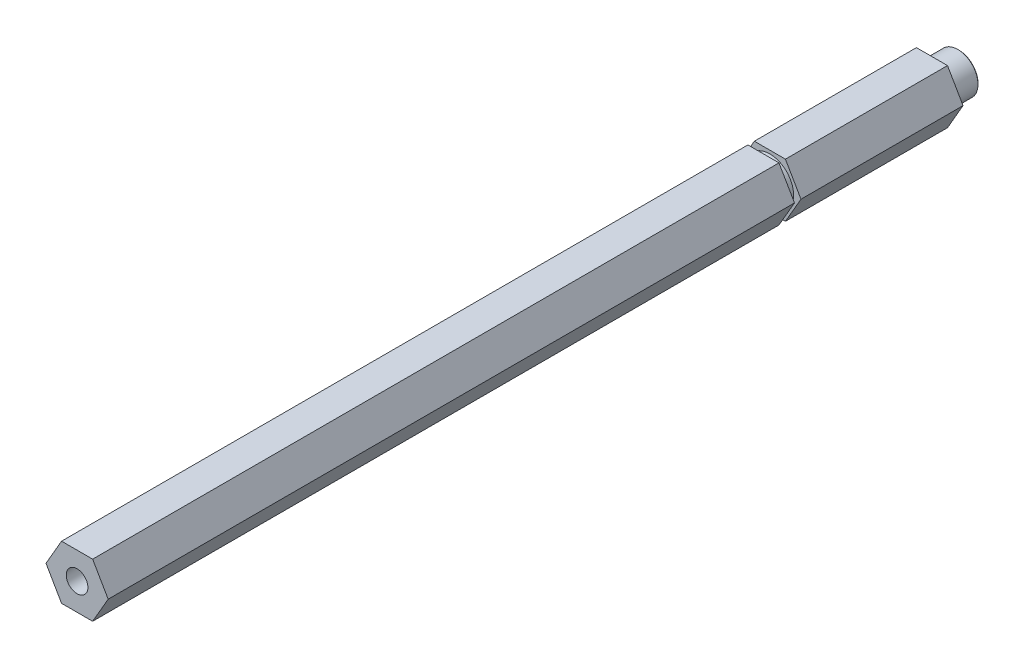
ISO-10303-21;
HEADER;
FILE_DESCRIPTION(('STEP AP214'),'2;1');
FILE_NAME('part.step','',(''),(''),'','','');
FILE_SCHEMA(('AUTOMOTIVE_DESIGN { 1 0 10303 214 1 1 1 1 }'));
ENDSEC;
DATA;
#1=APPLICATION_CONTEXT('core data for automotive mechanical design processes');
#2=APPLICATION_PROTOCOL_DEFINITION('international standard','automotive_design',2000,#1);
#3=PRODUCT_CONTEXT('',#1,'mechanical');
#4=PRODUCT('Part','Part','',(#3));
#5=PRODUCT_RELATED_PRODUCT_CATEGORY('part','',(#4));
#6=PRODUCT_DEFINITION_FORMATION('','',#4);
#7=PRODUCT_DEFINITION_CONTEXT('part definition',#1,'design');
#8=PRODUCT_DEFINITION('design','',#6,#7);
#9=PRODUCT_DEFINITION_SHAPE('','',#8);
#10=(LENGTH_UNIT() NAMED_UNIT(*) SI_UNIT(.MILLI.,.METRE.));
#11=(NAMED_UNIT(*) PLANE_ANGLE_UNIT() SI_UNIT($,.RADIAN.));
#12=(NAMED_UNIT(*) SI_UNIT($,.STERADIAN.) SOLID_ANGLE_UNIT());
#13=UNCERTAINTY_MEASURE_WITH_UNIT(LENGTH_MEASURE(1.E-05),#10,'distance_accuracy_value','');
#14=(GEOMETRIC_REPRESENTATION_CONTEXT(3) GLOBAL_UNCERTAINTY_ASSIGNED_CONTEXT((#13)) GLOBAL_UNIT_ASSIGNED_CONTEXT((#10,
#11,#12)) REPRESENTATION_CONTEXT('',''));
#15=CARTESIAN_POINT('',(0.,0.,0.));
#16=DIRECTION('',(0.,0.,1.));
#17=DIRECTION('',(1.,0.,0.));
#18=AXIS2_PLACEMENT_3D('',#15,#16,#17);
#19=CARTESIAN_POINT('',(0.,0.,11.176));
#20=DIRECTION('',(0.,0.,-1.));
#21=DIRECTION('',(-1.,0.,0.));
#22=AXIS2_PLACEMENT_3D('',#19,#20,#21);
#23=PLANE('',#22);
#24=CARTESIAN_POINT('',(0.,0.,11.176));
#25=DIRECTION('',(0.,0.,-1.));
#26=DIRECTION('',(-1.,0.,0.));
#27=AXIS2_PLACEMENT_3D('',#24,#25,#26);
#28=CIRCLE('',#27,3.175);
#29=CARTESIAN_POINT('',(-3.175,0.,11.176));
#30=VERTEX_POINT('',#29);
#31=EDGE_CURVE('E20',#30,#30,#28,.T.);
#32=ORIENTED_EDGE('',*,*,#31,.T.);
#33=EDGE_LOOP('',(#32));
#34=FACE_BOUND('',#33,.T.);
#35=ADVANCED_FACE('F17',(#34),#23,.T.);
#36=CARTESIAN_POINT('',(0.,0.,11.176));
#37=DIRECTION('',(0.,0.,-1.));
#38=DIRECTION('',(-1.,0.,0.));
#39=AXIS2_PLACEMENT_3D('',#36,#37,#38);
#40=CYLINDRICAL_SURFACE('',#39,3.175);
#41=CARTESIAN_POINT('',(0.,0.,0.253999999983989));
#42=DIRECTION('',(0.,0.,-1.));
#43=DIRECTION('',(-1.,0.,0.));
#44=AXIS2_PLACEMENT_3D('',#41,#42,#43);
#45=CIRCLE('',#44,3.17500000005566);
#46=CARTESIAN_POINT('',(-3.17500000005566,0.,0.253999999983989));
#47=VERTEX_POINT('',#46);
#48=EDGE_CURVE('E139',#47,#47,#45,.T.);
#49=ORIENTED_EDGE('',*,*,#48,.T.);
#50=EDGE_LOOP('',(#49));
#51=FACE_BOUND('',#50,.T.);
#52=ORIENTED_EDGE('',*,*,#31,.F.);
#53=EDGE_LOOP('',(#52));
#54=FACE_BOUND('',#53,.T.);
#55=ADVANCED_FACE('F401',(#51,#54),#40,.F.);
#56=CARTESIAN_POINT('',(0.,0.,5.6843418860808E-11));
#57=DIRECTION('',(0.,0.,-1.));
#58=DIRECTION('',(-1.,0.,0.));
#59=AXIS2_PLACEMENT_3D('',#56,#57,#58);
#60=CONICAL_SURFACE('',#59,3.42899999992596,0.785398163397448);
#61=CARTESIAN_POINT('',(0.,0.,0.));
#62=DIRECTION('',(0.,0.,-1.));
#63=DIRECTION('',(-1.,0.,0.));
#64=AXIS2_PLACEMENT_3D('',#61,#62,#63);
#65=CIRCLE('',#64,3.42899999998281);
#66=CARTESIAN_POINT('',(-3.42899999998281,0.,0.));
#67=VERTEX_POINT('',#66);
#68=EDGE_CURVE('E142',#67,#67,#65,.T.);
#69=ORIENTED_EDGE('',*,*,#68,.T.);
#70=EDGE_LOOP('',(#69));
#71=FACE_BOUND('',#70,.T.);
#72=ORIENTED_EDGE('',*,*,#48,.F.);
#73=EDGE_LOOP('',(#72));
#74=FACE_BOUND('',#73,.T.);
#75=ADVANCED_FACE('F163',(#71,#74),#60,.F.);
#76=CARTESIAN_POINT('',(0.,0.,0.));
#77=DIRECTION('',(0.,0.,1.));
#78=DIRECTION('',(1.,0.,0.));
#79=AXIS2_PLACEMENT_3D('',#76,#77,#78);
#80=PLANE('',#79);
#81=ORIENTED_EDGE('',*,*,#68,.F.);
#82=EDGE_LOOP('',(#81));
#83=FACE_BOUND('',#82,.T.);
#84=CARTESIAN_POINT('',(0.,0.,-5.6843418860808E-11));
#85=DIRECTION('',(0.,0.,1.));
#86=DIRECTION('',(1.,0.,0.));
#87=AXIS2_PLACEMENT_3D('',#84,#85,#86);
#88=CIRCLE('',#87,4.50849999998582);
#89=CARTESIAN_POINT('',(4.50849999998582,0.,-5.6843418860808E-11));
#90=VERTEX_POINT('',#89);
#91=EDGE_CURVE('E138',#90,#90,#88,.T.);
#92=ORIENTED_EDGE('',*,*,#91,.F.);
#93=EDGE_LOOP('',(#92));
#94=FACE_BOUND('',#93,.T.);
#95=ADVANCED_FACE('F166',(#83,#94),#80,.F.);
#96=CARTESIAN_POINT('',(0.,0.,0.254000000097676));
#97=DIRECTION('',(0.,0.,1.));
#98=DIRECTION('',(1.,0.,0.));
#99=AXIS2_PLACEMENT_3D('',#96,#97,#98);
#100=CONICAL_SURFACE('',#99,4.76250000014034,0.785398163397448);
#101=ORIENTED_EDGE('',*,*,#91,.T.);
#102=EDGE_LOOP('',(#101));
#103=FACE_BOUND('',#102,.T.);
#104=CARTESIAN_POINT('',(0.,0.,0.253999999999984));
#105=DIRECTION('',(0.,0.,-1.));
#106=DIRECTION('',(-1.,0.,0.));
#107=AXIS2_PLACEMENT_3D('',#104,#105,#106);
#108=CIRCLE('',#107,4.7625);
#109=CARTESIAN_POINT('',(-4.7625,0.,0.253999999999984));
#110=VERTEX_POINT('',#109);
#111=EDGE_CURVE('E135',#110,#110,#108,.F.);
#112=ORIENTED_EDGE('',*,*,#111,.F.);
#113=EDGE_LOOP('',(#112));
#114=FACE_BOUND('',#113,.T.);
#115=ADVANCED_FACE('F169',(#103,#114),#100,.T.);
#116=CARTESIAN_POINT('',(0.,0.,6.35));
#117=DIRECTION('',(0.,0.,-1.));
#118=DIRECTION('',(-1.,0.,0.));
#119=AXIS2_PLACEMENT_3D('',#116,#117,#118);
#120=CYLINDRICAL_SURFACE('',#119,4.7625);
#121=CARTESIAN_POINT('',(0.,0.,6.35));
#122=DIRECTION('',(0.,0.,-1.));
#123=DIRECTION('',(-1.,0.,0.));
#124=AXIS2_PLACEMENT_3D('',#121,#122,#123);
#125=CIRCLE('',#124,4.7625);
#126=CARTESIAN_POINT('',(-4.7625,0.,6.35));
#127=VERTEX_POINT('',#126);
#128=EDGE_CURVE('E117',#127,#127,#125,.T.);
#129=ORIENTED_EDGE('',*,*,#128,.T.);
#130=EDGE_LOOP('',(#129));
#131=FACE_BOUND('',#130,.T.);
#132=ORIENTED_EDGE('',*,*,#111,.T.);
#133=EDGE_LOOP('',(#132));
#134=FACE_BOUND('',#133,.T.);
#135=ADVANCED_FACE('F175',(#131,#134),#120,.T.);
#136=CARTESIAN_POINT('',(0.,0.,6.35));
#137=DIRECTION('',(0.,0.,1.));
#138=DIRECTION('',(1.,0.,0.));
#139=AXIS2_PLACEMENT_3D('',#136,#137,#138);
#140=PLANE('',#139);
#141=ORIENTED_EDGE('',*,*,#128,.F.);
#142=EDGE_LOOP('',(#141));
#143=FACE_BOUND('',#142,.T.);
#144=DIRECTION('',(-1.,0.,0.));
#145=VECTOR('',#144,1.);
#146=CARTESIAN_POINT('',(-3.66617420935412,-6.35,6.35));
#147=LINE('',#146,#145);
#148=CARTESIAN_POINT('',(3.66617420935412,-6.35,6.35));
#149=VERTEX_POINT('',#148);
#150=CARTESIAN_POINT('',(-3.66617420935412,-6.35,6.35));
#151=VERTEX_POINT('',#150);
#152=EDGE_CURVE('E481',#149,#151,#147,.T.);
#153=ORIENTED_EDGE('',*,*,#152,.T.);
#154=DIRECTION('',(-0.5,0.866025403784438,0.));
#155=VECTOR('',#154,1.);
#156=CARTESIAN_POINT('',(-7.33234841870825,0.,6.35));
#157=LINE('',#156,#155);
#158=CARTESIAN_POINT('',(-7.33234841870825,0.,6.35));
#159=VERTEX_POINT('',#158);
#160=EDGE_CURVE('E491',#151,#159,#157,.T.);
#161=ORIENTED_EDGE('',*,*,#160,.T.);
#162=DIRECTION('',(0.5,0.866025403784439,0.));
#163=VECTOR('',#162,1.);
#164=CARTESIAN_POINT('',(-3.66617420935412,6.35,6.35));
#165=LINE('',#164,#163);
#166=CARTESIAN_POINT('',(-3.66617420935412,6.35,6.35));
#167=VERTEX_POINT('',#166);
#168=EDGE_CURVE('E463',#159,#167,#165,.T.);
#169=ORIENTED_EDGE('',*,*,#168,.T.);
#170=DIRECTION('',(1.,0.,0.));
#171=VECTOR('',#170,1.);
#172=CARTESIAN_POINT('',(3.66617420935412,6.35,6.35));
#173=LINE('',#172,#171);
#174=CARTESIAN_POINT('',(3.66617420935412,6.35,6.35));
#175=VERTEX_POINT('',#174);
#176=EDGE_CURVE('E129',#167,#175,#173,.T.);
#177=ORIENTED_EDGE('',*,*,#176,.T.);
#178=DIRECTION('',(0.5,-0.866025403784439,0.));
#179=VECTOR('',#178,1.);
#180=CARTESIAN_POINT('',(7.33234841870825,0.,6.34999999999999));
#181=LINE('',#180,#179);
#182=CARTESIAN_POINT('',(7.33234841870825,0.,6.35));
#183=VERTEX_POINT('',#182);
#184=EDGE_CURVE('E122',#175,#183,#181,.T.);
#185=ORIENTED_EDGE('',*,*,#184,.T.);
#186=DIRECTION('',(-0.5,-0.866025403784439,0.));
#187=VECTOR('',#186,1.);
#188=CARTESIAN_POINT('',(3.66617420935412,-6.35,6.35));
#189=LINE('',#188,#187);
#190=EDGE_CURVE('E106',#183,#149,#189,.T.);
#191=ORIENTED_EDGE('',*,*,#190,.T.);
#192=EDGE_LOOP('',(#153,#161,#169,#177,#185,#191));
#193=FACE_BOUND('',#192,.T.);
#194=ADVANCED_FACE('F127',(#143,#193),#140,.F.);
#195=CARTESIAN_POINT('',(3.66617420935412,-6.35,44.577));
#196=DIRECTION('',(-0.866025403784439,0.5,0.));
#197=DIRECTION('',(-0.5,-0.866025403784439,0.));
#198=AXIS2_PLACEMENT_3D('',#195,#196,#197);
#199=PLANE('',#198);
#200=DIRECTION('',(0.,0.,1.));
#201=VECTOR('',#200,1.);
#202=CARTESIAN_POINT('',(7.33234841870825,0.,44.577));
#203=LINE('',#202,#201);
#204=CARTESIAN_POINT('',(7.33234841870825,0.,44.577));
#205=VERTEX_POINT('',#204);
#206=EDGE_CURVE('E110',#183,#205,#203,.T.);
#207=ORIENTED_EDGE('',*,*,#206,.T.);
#208=DIRECTION('',(0.5,0.866025403784439,0.));
#209=VECTOR('',#208,1.);
#210=CARTESIAN_POINT('',(3.66617420935412,-6.35,44.577));
#211=LINE('',#210,#209);
#212=CARTESIAN_POINT('',(3.66617420935412,-6.35,44.577));
#213=VERTEX_POINT('',#212);
#214=EDGE_CURVE('E479',#213,#205,#211,.T.);
#215=ORIENTED_EDGE('',*,*,#214,.F.);
#216=DIRECTION('',(0.,0.,1.));
#217=VECTOR('',#216,1.);
#218=CARTESIAN_POINT('',(3.66617420935412,-6.35,44.577));
#219=LINE('',#218,#217);
#220=EDGE_CURVE('E112',#213,#149,#219,.F.);
#221=ORIENTED_EDGE('',*,*,#220,.T.);
#222=ORIENTED_EDGE('',*,*,#190,.F.);
#223=EDGE_LOOP('',(#207,#215,#221,#222));
#224=FACE_BOUND('',#223,.T.);
#225=ADVANCED_FACE('F108',(#224),#199,.F.);
#226=CARTESIAN_POINT('',(7.33234841870825,0.,44.577));
#227=DIRECTION('',(-0.866025403784439,-0.5,0.));
#228=DIRECTION('',(0.5,-0.866025403784439,0.));
#229=AXIS2_PLACEMENT_3D('',#226,#227,#228);
#230=PLANE('',#229);
#231=DIRECTION('',(0.,0.,-1.));
#232=VECTOR('',#231,1.);
#233=CARTESIAN_POINT('',(3.66617420935412,6.35,44.577));
#234=LINE('',#233,#232);
#235=CARTESIAN_POINT('',(3.66617420935412,6.35,44.577));
#236=VERTEX_POINT('',#235);
#237=EDGE_CURVE('E130',#175,#236,#234,.F.);
#238=ORIENTED_EDGE('',*,*,#237,.T.);
#239=DIRECTION('',(-0.5,0.866025403784438,0.));
#240=VECTOR('',#239,1.);
#241=CARTESIAN_POINT('',(7.33234841870825,0.,44.577));
#242=LINE('',#241,#240);
#243=EDGE_CURVE('E124',#205,#236,#242,.T.);
#244=ORIENTED_EDGE('',*,*,#243,.F.);
#245=ORIENTED_EDGE('',*,*,#206,.F.);
#246=ORIENTED_EDGE('',*,*,#184,.F.);
#247=EDGE_LOOP('',(#238,#244,#245,#246));
#248=FACE_BOUND('',#247,.T.);
#249=ADVANCED_FACE('F121',(#248),#230,.F.);
#250=CARTESIAN_POINT('',(3.66617420935412,6.35,44.577));
#251=DIRECTION('',(0.,-1.,0.));
#252=DIRECTION('',(0.,0.,-1.));
#253=AXIS2_PLACEMENT_3D('',#250,#251,#252);
#254=PLANE('',#253);
#255=DIRECTION('',(0.,0.,1.));
#256=VECTOR('',#255,1.);
#257=CARTESIAN_POINT('',(-3.66617420935412,6.35,44.577));
#258=LINE('',#257,#256);
#259=CARTESIAN_POINT('',(-3.66617420935412,6.35,44.577));
#260=VERTEX_POINT('',#259);
#261=EDGE_CURVE('E460',#167,#260,#258,.T.);
#262=ORIENTED_EDGE('',*,*,#261,.T.);
#263=DIRECTION('',(1.,0.,0.));
#264=VECTOR('',#263,1.);
#265=CARTESIAN_POINT('',(0.,6.35,44.577));
#266=LINE('',#265,#264);
#267=EDGE_CURVE('E462',#236,#260,#266,.F.);
#268=ORIENTED_EDGE('',*,*,#267,.F.);
#269=ORIENTED_EDGE('',*,*,#237,.F.);
#270=ORIENTED_EDGE('',*,*,#176,.F.);
#271=EDGE_LOOP('',(#262,#268,#269,#270));
#272=FACE_BOUND('',#271,.T.);
#273=ADVANCED_FACE('F251',(#272),#254,.F.);
#274=CARTESIAN_POINT('',(-3.66617420935412,6.35,44.577));
#275=DIRECTION('',(0.866025403784439,-0.5,0.));
#276=DIRECTION('',(0.5,0.866025403784439,0.));
#277=AXIS2_PLACEMENT_3D('',#274,#275,#276);
#278=PLANE('',#277);
#279=DIRECTION('',(0.,0.,1.));
#280=VECTOR('',#279,1.);
#281=CARTESIAN_POINT('',(-7.33234841870825,0.,44.577));
#282=LINE('',#281,#280);
#283=CARTESIAN_POINT('',(-7.33234841870825,0.,44.577));
#284=VERTEX_POINT('',#283);
#285=EDGE_CURVE('E468',#159,#284,#282,.T.);
#286=ORIENTED_EDGE('',*,*,#285,.T.);
#287=DIRECTION('',(-0.5,-0.866025403784438,0.));
#288=VECTOR('',#287,1.);
#289=CARTESIAN_POINT('',(-3.66617420935412,6.35,44.577));
#290=LINE('',#289,#288);
#291=EDGE_CURVE('E466',#260,#284,#290,.T.);
#292=ORIENTED_EDGE('',*,*,#291,.F.);
#293=ORIENTED_EDGE('',*,*,#261,.F.);
#294=ORIENTED_EDGE('',*,*,#168,.F.);
#295=EDGE_LOOP('',(#286,#292,#293,#294));
#296=FACE_BOUND('',#295,.T.);
#297=ADVANCED_FACE('F247',(#296),#278,.F.);
#298=CARTESIAN_POINT('',(-7.33234841870825,0.,44.577));
#299=DIRECTION('',(0.866025403784438,0.5,0.));
#300=DIRECTION('',(-0.5,0.866025403784438,0.));
#301=AXIS2_PLACEMENT_3D('',#298,#299,#300);
#302=PLANE('',#301);
#303=DIRECTION('',(0.,0.,1.));
#304=VECTOR('',#303,1.);
#305=CARTESIAN_POINT('',(-3.66617420935412,-6.35,44.577));
#306=LINE('',#305,#304);
#307=CARTESIAN_POINT('',(-3.66617420935412,-6.35,44.577));
#308=VERTEX_POINT('',#307);
#309=EDGE_CURVE('E488',#151,#308,#306,.T.);
#310=ORIENTED_EDGE('',*,*,#309,.T.);
#311=DIRECTION('',(0.5,-0.866025403784438,0.));
#312=VECTOR('',#311,1.);
#313=CARTESIAN_POINT('',(-7.33234841870825,0.,44.577));
#314=LINE('',#313,#312);
#315=EDGE_CURVE('E471',#284,#308,#314,.T.);
#316=ORIENTED_EDGE('',*,*,#315,.F.);
#317=ORIENTED_EDGE('',*,*,#285,.F.);
#318=ORIENTED_EDGE('',*,*,#160,.F.);
#319=EDGE_LOOP('',(#310,#316,#317,#318));
#320=FACE_BOUND('',#319,.T.);
#321=ADVANCED_FACE('F243',(#320),#302,.F.);
#322=CARTESIAN_POINT('',(-3.66617420935412,-6.35,44.577));
#323=DIRECTION('',(0.,1.,0.));
#324=DIRECTION('',(-1.,0.,0.));
#325=AXIS2_PLACEMENT_3D('',#322,#323,#324);
#326=PLANE('',#325);
#327=ORIENTED_EDGE('',*,*,#220,.F.);
#328=DIRECTION('',(1.,0.,0.));
#329=VECTOR('',#328,1.);
#330=CARTESIAN_POINT('',(0.,-6.35,44.577));
#331=LINE('',#330,#329);
#332=EDGE_CURVE('E473',#308,#213,#331,.T.);
#333=ORIENTED_EDGE('',*,*,#332,.F.);
#334=ORIENTED_EDGE('',*,*,#309,.F.);
#335=ORIENTED_EDGE('',*,*,#152,.F.);
#336=EDGE_LOOP('',(#327,#333,#334,#335));
#337=FACE_BOUND('',#336,.T.);
#338=ADVANCED_FACE('F239',(#337),#326,.F.);
#339=CARTESIAN_POINT('',(0.,0.,191.46773999995));
#340=DIRECTION('',(0.,0.,1.));
#341=DIRECTION('',(1.,0.,0.));
#342=AXIS2_PLACEMENT_3D('',#339,#340,#341);
#343=CONICAL_SURFACE('',#342,2.55269999991015,1.02974425853382);
#344=CARTESIAN_POINT('',(-1.70530256582424E-10,0.,189.933923097726));
#345=VERTEX_POINT('',#344);
#346=VERTEX_LOOP('',#345);
#347=FACE_BOUND('',#346,.T.);
#348=CARTESIAN_POINT('',(0.,0.,191.46774));
#349=DIRECTION('',(0.,0.,1.));
#350=DIRECTION('',(1.,0.,0.));
#351=AXIS2_PLACEMENT_3D('',#348,#349,#350);
#352=CIRCLE('',#351,2.55269999999999);
#353=CARTESIAN_POINT('',(2.55269999999999,0.,191.46774));
#354=VERTEX_POINT('',#353);
#355=EDGE_CURVE('E482',#354,#354,#352,.T.);
#356=ORIENTED_EDGE('',*,*,#355,.T.);
#357=EDGE_LOOP('',(#356));
#358=FACE_BOUND('',#357,.T.);
#359=ADVANCED_FACE('F235',(#347,#358),#343,.F.);
#360=CARTESIAN_POINT('',(0.,0.,44.577));
#361=DIRECTION('',(0.,0.,1.));
#362=DIRECTION('',(1.,0.,0.));
#363=AXIS2_PLACEMENT_3D('',#360,#361,#362);
#364=PLANE('',#363);
#365=CARTESIAN_POINT('',(0.,0.,44.577));
#366=DIRECTION('',(0.,0.,-1.));
#367=DIRECTION('',(-1.,0.,0.));
#368=AXIS2_PLACEMENT_3D('',#365,#366,#367);
#369=CIRCLE('',#368,5.588);
#370=CARTESIAN_POINT('',(-5.588,0.,44.577));
#371=VERTEX_POINT('',#370);
#372=EDGE_CURVE('E153',#371,#371,#369,.F.);
#373=ORIENTED_EDGE('',*,*,#372,.F.);
#374=EDGE_LOOP('',(#373));
#375=FACE_BOUND('',#374,.T.);
#376=ORIENTED_EDGE('',*,*,#315,.T.);
#377=ORIENTED_EDGE('',*,*,#332,.T.);
#378=ORIENTED_EDGE('',*,*,#214,.T.);
#379=ORIENTED_EDGE('',*,*,#243,.T.);
#380=ORIENTED_EDGE('',*,*,#267,.T.);
#381=ORIENTED_EDGE('',*,*,#291,.T.);
#382=EDGE_LOOP('',(#376,#377,#378,#379,#380,#381));
#383=FACE_BOUND('',#382,.T.);
#384=ADVANCED_FACE('F231',(#375,#383),#364,.T.);
#385=CARTESIAN_POINT('',(0.,0.,207.97774));
#386=DIRECTION('',(0.,0.,1.));
#387=DIRECTION('',(1.,0.,0.));
#388=AXIS2_PLACEMENT_3D('',#385,#386,#387);
#389=CYLINDRICAL_SURFACE('',#388,2.55269999999999);
#390=CARTESIAN_POINT('',(0.,0.,207.97774));
#391=DIRECTION('',(0.,0.,1.));
#392=DIRECTION('',(1.,0.,0.));
#393=AXIS2_PLACEMENT_3D('',#390,#391,#392);
#394=CIRCLE('',#393,2.55269999999999);
#395=CARTESIAN_POINT('',(2.55269999999999,0.,207.97774));
#396=VERTEX_POINT('',#395);
#397=EDGE_CURVE('E148',#396,#396,#394,.F.);
#398=ORIENTED_EDGE('',*,*,#397,.F.);
#399=EDGE_LOOP('',(#398));
#400=FACE_BOUND('',#399,.T.);
#401=ORIENTED_EDGE('',*,*,#355,.F.);
#402=EDGE_LOOP('',(#401));
#403=FACE_BOUND('',#402,.T.);
#404=ADVANCED_FACE('F227',(#400,#403),#389,.F.);
#405=CARTESIAN_POINT('',(3.66617420935412,6.35,207.97774));
#406=DIRECTION('',(0.,-1.,0.));
#407=DIRECTION('',(1.,0.,0.));
#408=AXIS2_PLACEMENT_3D('',#405,#406,#407);
#409=PLANE('',#408);
#410=DIRECTION('',(0.,0.,1.));
#411=VECTOR('',#410,1.);
#412=CARTESIAN_POINT('',(-3.66617420935413,6.35,207.97774));
#413=LINE('',#412,#411);
#414=CARTESIAN_POINT('',(-3.66617420935413,6.35,46.101));
#415=VERTEX_POINT('',#414);
#416=CARTESIAN_POINT('',(-3.66617420935413,6.35,207.97774));
#417=VERTEX_POINT('',#416);
#418=EDGE_CURVE('E485',#415,#417,#413,.T.);
#419=ORIENTED_EDGE('',*,*,#418,.T.);
#420=DIRECTION('',(1.,0.,0.));
#421=VECTOR('',#420,1.);
#422=CARTESIAN_POINT('',(0.,6.35,207.97774));
#423=LINE('',#422,#421);
#424=CARTESIAN_POINT('',(3.66617420935412,6.35,207.97774));
#425=VERTEX_POINT('',#424);
#426=EDGE_CURVE('E151',#425,#417,#423,.F.);
#427=ORIENTED_EDGE('',*,*,#426,.F.);
#428=DIRECTION('',(0.,0.,1.));
#429=VECTOR('',#428,1.);
#430=CARTESIAN_POINT('',(3.66617420935412,6.35,207.97774));
#431=LINE('',#430,#429);
#432=CARTESIAN_POINT('',(3.66617420935412,6.35,46.101));
#433=VERTEX_POINT('',#432);
#434=EDGE_CURVE('E515',#425,#433,#431,.F.);
#435=ORIENTED_EDGE('',*,*,#434,.T.);
#436=DIRECTION('',(1.,0.,0.));
#437=VECTOR('',#436,1.);
#438=CARTESIAN_POINT('',(0.,6.35,46.101));
#439=LINE('',#438,#437);
#440=EDGE_CURVE('E518',#433,#415,#439,.F.);
#441=ORIENTED_EDGE('',*,*,#440,.T.);
#442=EDGE_LOOP('',(#419,#427,#435,#441));
#443=FACE_BOUND('',#442,.T.);
#444=ADVANCED_FACE('F223',(#443),#409,.F.);
#445=CARTESIAN_POINT('',(-3.66617420935413,6.35,207.97774));
#446=DIRECTION('',(0.866025403784439,-0.499999999999999,0.));
#447=DIRECTION('',(0.499999999999999,0.866025403784439,0.));
#448=AXIS2_PLACEMENT_3D('',#445,#446,#447);
#449=PLANE('',#448);
#450=DIRECTION('',(0.,0.,1.));
#451=VECTOR('',#450,1.);
#452=CARTESIAN_POINT('',(-7.33234841870824,0.,207.97774));
#453=LINE('',#452,#451);
#454=CARTESIAN_POINT('',(-7.33234841870825,0.,46.101));
#455=VERTEX_POINT('',#454);
#456=CARTESIAN_POINT('',(-7.33234841870825,0.,207.97774));
#457=VERTEX_POINT('',#456);
#458=EDGE_CURVE('E156',#455,#457,#453,.T.);
#459=ORIENTED_EDGE('',*,*,#458,.T.);
#460=DIRECTION('',(-0.499999999999999,-0.866025403784439,0.));
#461=VECTOR('',#460,1.);
#462=CARTESIAN_POINT('',(-3.66617420935413,6.35,207.97774));
#463=LINE('',#462,#461);
#464=EDGE_CURVE('E506',#417,#457,#463,.T.);
#465=ORIENTED_EDGE('',*,*,#464,.F.);
#466=ORIENTED_EDGE('',*,*,#418,.F.);
#467=DIRECTION('',(-0.499999999999999,-0.866025403784439,0.));
#468=VECTOR('',#467,1.);
#469=CARTESIAN_POINT('',(-3.66617420935413,6.35,46.101));
#470=LINE('',#469,#468);
#471=EDGE_CURVE('E521',#415,#455,#470,.T.);
#472=ORIENTED_EDGE('',*,*,#471,.T.);
#473=EDGE_LOOP('',(#459,#465,#466,#472));
#474=FACE_BOUND('',#473,.T.);
#475=ADVANCED_FACE('F219',(#474),#449,.F.);
#476=CARTESIAN_POINT('',(-7.33234841870824,0.,207.97774));
#477=DIRECTION('',(0.866025403784438,0.5,0.));
#478=DIRECTION('',(-0.5,0.866025403784438,0.));
#479=AXIS2_PLACEMENT_3D('',#476,#477,#478);
#480=PLANE('',#479);
#481=DIRECTION('',(0.,0.,1.));
#482=VECTOR('',#481,1.);
#483=CARTESIAN_POINT('',(-3.66617420935412,-6.35,207.97774));
#484=LINE('',#483,#482);
#485=CARTESIAN_POINT('',(-3.66617420935412,-6.35,46.101));
#486=VERTEX_POINT('',#485);
#487=CARTESIAN_POINT('',(-3.66617420935412,-6.35,207.97774));
#488=VERTEX_POINT('',#487);
#489=EDGE_CURVE('E152',#486,#488,#484,.T.);
#490=ORIENTED_EDGE('',*,*,#489,.T.);
#491=DIRECTION('',(0.5,-0.866025403784439,0.));
#492=VECTOR('',#491,1.);
#493=CARTESIAN_POINT('',(-7.33234841870824,0.,207.97774));
#494=LINE('',#493,#492);
#495=EDGE_CURVE('E508',#457,#488,#494,.T.);
#496=ORIENTED_EDGE('',*,*,#495,.F.);
#497=ORIENTED_EDGE('',*,*,#458,.F.);
#498=DIRECTION('',(0.5,-0.866025403784439,0.));
#499=VECTOR('',#498,1.);
#500=CARTESIAN_POINT('',(-7.33234841870824,0.,46.101));
#501=LINE('',#500,#499);
#502=EDGE_CURVE('E524',#455,#486,#501,.T.);
#503=ORIENTED_EDGE('',*,*,#502,.T.);
#504=EDGE_LOOP('',(#490,#496,#497,#503));
#505=FACE_BOUND('',#504,.T.);
#506=ADVANCED_FACE('F215',(#505),#480,.F.);
#507=CARTESIAN_POINT('',(0.,0.,46.101));
#508=DIRECTION('',(0.,0.,-1.));
#509=DIRECTION('',(-1.,0.,0.));
#510=AXIS2_PLACEMENT_3D('',#507,#508,#509);
#511=CYLINDRICAL_SURFACE('',#510,5.588);
#512=CARTESIAN_POINT('',(0.,0.,46.101));
#513=DIRECTION('',(0.,0.,-1.));
#514=DIRECTION('',(-1.,0.,0.));
#515=AXIS2_PLACEMENT_3D('',#512,#513,#514);
#516=CIRCLE('',#515,5.588);
#517=CARTESIAN_POINT('',(-5.588,0.,46.101));
#518=VERTEX_POINT('',#517);
#519=EDGE_CURVE('E143',#518,#518,#516,.T.);
#520=ORIENTED_EDGE('',*,*,#519,.T.);
#521=EDGE_LOOP('',(#520));
#522=FACE_BOUND('',#521,.T.);
#523=ORIENTED_EDGE('',*,*,#372,.T.);
#524=EDGE_LOOP('',(#523));
#525=FACE_BOUND('',#524,.T.);
#526=ADVANCED_FACE('F211',(#522,#525),#511,.T.);
#527=CARTESIAN_POINT('',(-3.66617420935412,-6.35,207.97774));
#528=DIRECTION('',(0.,1.,0.));
#529=DIRECTION('',(-1.,0.,0.));
#530=AXIS2_PLACEMENT_3D('',#527,#528,#529);
#531=PLANE('',#530);
#532=DIRECTION('',(0.,0.,1.));
#533=VECTOR('',#532,1.);
#534=CARTESIAN_POINT('',(3.66617420935413,-6.35,207.97774));
#535=LINE('',#534,#533);
#536=CARTESIAN_POINT('',(3.66617420935413,-6.35,46.101));
#537=VERTEX_POINT('',#536);
#538=CARTESIAN_POINT('',(3.66617420935413,-6.35,207.97774));
#539=VERTEX_POINT('',#538);
#540=EDGE_CURVE('E146',#537,#539,#535,.T.);
#541=ORIENTED_EDGE('',*,*,#540,.T.);
#542=DIRECTION('',(1.,0.,0.));
#543=VECTOR('',#542,1.);
#544=CARTESIAN_POINT('',(0.,-6.35,207.97774));
#545=LINE('',#544,#543);
#546=EDGE_CURVE('E510',#488,#539,#545,.T.);
#547=ORIENTED_EDGE('',*,*,#546,.F.);
#548=ORIENTED_EDGE('',*,*,#489,.F.);
#549=DIRECTION('',(1.,0.,0.));
#550=VECTOR('',#549,1.);
#551=CARTESIAN_POINT('',(0.,-6.35,46.101));
#552=LINE('',#551,#550);
#553=EDGE_CURVE('E147',#486,#537,#552,.T.);
#554=ORIENTED_EDGE('',*,*,#553,.T.);
#555=EDGE_LOOP('',(#541,#547,#548,#554));
#556=FACE_BOUND('',#555,.T.);
#557=ADVANCED_FACE('F207',(#556),#531,.F.);
#558=CARTESIAN_POINT('',(0.,0.,207.97774));
#559=DIRECTION('',(0.,0.,1.));
#560=DIRECTION('',(1.,0.,0.));
#561=AXIS2_PLACEMENT_3D('',#558,#559,#560);
#562=PLANE('',#561);
#563=ORIENTED_EDGE('',*,*,#495,.T.);
#564=ORIENTED_EDGE('',*,*,#546,.T.);
#565=DIRECTION('',(-0.499999999999999,-0.866025403784439,0.));
#566=VECTOR('',#565,1.);
#567=CARTESIAN_POINT('',(3.66617420935413,-6.35,207.97774));
#568=LINE('',#567,#566);
#569=CARTESIAN_POINT('',(7.33234841870824,0.,207.97774));
#570=VERTEX_POINT('',#569);
#571=EDGE_CURVE('E531',#539,#570,#568,.F.);
#572=ORIENTED_EDGE('',*,*,#571,.T.);
#573=DIRECTION('',(0.5,-0.866025403784439,0.));
#574=VECTOR('',#573,1.);
#575=CARTESIAN_POINT('',(7.33234841870824,0.,207.97774));
#576=LINE('',#575,#574);
#577=EDGE_CURVE('E512',#570,#425,#576,.F.);
#578=ORIENTED_EDGE('',*,*,#577,.T.);
#579=ORIENTED_EDGE('',*,*,#426,.T.);
#580=ORIENTED_EDGE('',*,*,#464,.T.);
#581=EDGE_LOOP('',(#563,#564,#572,#578,#579,#580));
#582=FACE_BOUND('',#581,.T.);
#583=ORIENTED_EDGE('',*,*,#397,.T.);
#584=EDGE_LOOP('',(#583));
#585=FACE_BOUND('',#584,.T.);
#586=ADVANCED_FACE('F203',(#582,#585),#562,.T.);
#587=CARTESIAN_POINT('',(7.33234841870824,0.,207.97774));
#588=DIRECTION('',(-0.866025403784439,-0.5,0.));
#589=DIRECTION('',(0.5,-0.866025403784439,0.));
#590=AXIS2_PLACEMENT_3D('',#587,#588,#589);
#591=PLANE('',#590);
#592=ORIENTED_EDGE('',*,*,#434,.F.);
#593=ORIENTED_EDGE('',*,*,#577,.F.);
#594=DIRECTION('',(0.,0.,1.));
#595=VECTOR('',#594,1.);
#596=CARTESIAN_POINT('',(7.33234841870824,0.,207.97774));
#597=LINE('',#596,#595);
#598=CARTESIAN_POINT('',(7.33234841870824,0.,46.101));
#599=VERTEX_POINT('',#598);
#600=EDGE_CURVE('E26',#570,#599,#597,.F.);
#601=ORIENTED_EDGE('',*,*,#600,.T.);
#602=DIRECTION('',(-0.5,0.866025403784439,0.));
#603=VECTOR('',#602,1.);
#604=CARTESIAN_POINT('',(7.33234841870824,0.,46.101));
#605=LINE('',#604,#603);
#606=EDGE_CURVE('E34',#599,#433,#605,.T.);
#607=ORIENTED_EDGE('',*,*,#606,.T.);
#608=EDGE_LOOP('',(#592,#593,#601,#607));
#609=FACE_BOUND('',#608,.T.);
#610=ADVANCED_FACE('F196',(#609),#591,.F.);
#611=CARTESIAN_POINT('',(0.,0.,46.101));
#612=DIRECTION('',(0.,0.,1.));
#613=DIRECTION('',(1.,0.,0.));
#614=AXIS2_PLACEMENT_3D('',#611,#612,#613);
#615=PLANE('',#614);
#616=ORIENTED_EDGE('',*,*,#519,.F.);
#617=EDGE_LOOP('',(#616));
#618=FACE_BOUND('',#617,.T.);
#619=ORIENTED_EDGE('',*,*,#553,.F.);
#620=ORIENTED_EDGE('',*,*,#502,.F.);
#621=ORIENTED_EDGE('',*,*,#471,.F.);
#622=ORIENTED_EDGE('',*,*,#440,.F.);
#623=ORIENTED_EDGE('',*,*,#606,.F.);
#624=DIRECTION('',(-0.499999999999999,-0.866025403784439,0.));
#625=VECTOR('',#624,1.);
#626=CARTESIAN_POINT('',(3.66617420935413,-6.35,46.101));
#627=LINE('',#626,#625);
#628=EDGE_CURVE('E11',#599,#537,#627,.T.);
#629=ORIENTED_EDGE('',*,*,#628,.T.);
#630=EDGE_LOOP('',(#619,#620,#621,#622,#623,#629));
#631=FACE_BOUND('',#630,.T.);
#632=ADVANCED_FACE('F190',(#618,#631),#615,.F.);
#633=CARTESIAN_POINT('',(3.66617420935413,-6.35,207.97774));
#634=DIRECTION('',(-0.866025403784439,0.499999999999999,0.));
#635=DIRECTION('',(-0.499999999999999,-0.866025403784439,0.));
#636=AXIS2_PLACEMENT_3D('',#633,#634,#635);
#637=PLANE('',#636);
#638=ORIENTED_EDGE('',*,*,#600,.F.);
#639=ORIENTED_EDGE('',*,*,#571,.F.);
#640=ORIENTED_EDGE('',*,*,#540,.F.);
#641=ORIENTED_EDGE('',*,*,#628,.F.);
#642=EDGE_LOOP('',(#638,#639,#640,#641));
#643=FACE_BOUND('',#642,.T.);
#644=ADVANCED_FACE('F188',(#643),#637,.F.);
#645=CLOSED_SHELL('',(#35,#55,#75,#95,#115,#135,#194,#225,#249,#273,#297,#321,#338,#359,#384,
#404,#444,#475,#506,#526,#557,#586,#610,#632,#644));
#646=MANIFOLD_SOLID_BREP('B1',#645);
#647=ADVANCED_BREP_SHAPE_REPRESENTATION('',(#18,#646),#14);
#648=SHAPE_DEFINITION_REPRESENTATION(#9,#647);
ENDSEC;
END-ISO-10303-21;
